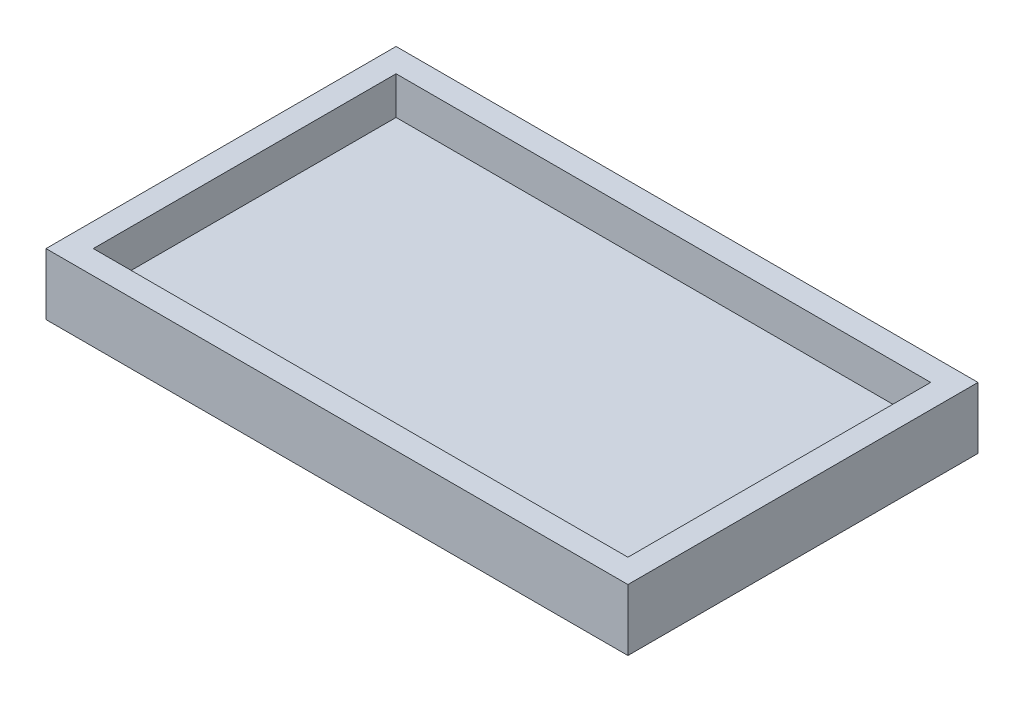
ISO-10303-21;
HEADER;
FILE_DESCRIPTION(('STEP AP214'),'2;1');
FILE_NAME('part.step','',(''),(''),'','','');
FILE_SCHEMA(('AUTOMOTIVE_DESIGN { 1 0 10303 214 1 1 1 1 }'));
ENDSEC;
DATA;
#1=APPLICATION_CONTEXT('core data for automotive mechanical design processes');
#2=APPLICATION_PROTOCOL_DEFINITION('international standard','automotive_design',2000,#1);
#3=PRODUCT_CONTEXT('',#1,'mechanical');
#4=PRODUCT('Part','Part','',(#3));
#5=PRODUCT_RELATED_PRODUCT_CATEGORY('part','',(#4));
#6=PRODUCT_DEFINITION_FORMATION('','',#4);
#7=PRODUCT_DEFINITION_CONTEXT('part definition',#1,'design');
#8=PRODUCT_DEFINITION('design','',#6,#7);
#9=PRODUCT_DEFINITION_SHAPE('','',#8);
#10=(LENGTH_UNIT() NAMED_UNIT(*) SI_UNIT(.MILLI.,.METRE.));
#11=(NAMED_UNIT(*) PLANE_ANGLE_UNIT() SI_UNIT($,.RADIAN.));
#12=(NAMED_UNIT(*) SI_UNIT($,.STERADIAN.) SOLID_ANGLE_UNIT());
#13=UNCERTAINTY_MEASURE_WITH_UNIT(LENGTH_MEASURE(1.E-05),#10,'distance_accuracy_value','');
#14=(GEOMETRIC_REPRESENTATION_CONTEXT(3) GLOBAL_UNCERTAINTY_ASSIGNED_CONTEXT((#13)) GLOBAL_UNIT_ASSIGNED_CONTEXT((#10,
#11,#12)) REPRESENTATION_CONTEXT('',''));
#15=CARTESIAN_POINT('',(0.,0.,0.));
#16=DIRECTION('',(0.,0.,1.));
#17=DIRECTION('',(1.,0.,0.));
#18=AXIS2_PLACEMENT_3D('',#15,#16,#17);
#19=CARTESIAN_POINT('',(-61.5,13.,-37.));
#20=DIRECTION('',(1.,0.,0.));
#21=DIRECTION('',(0.,0.,-1.));
#22=AXIS2_PLACEMENT_3D('',#19,#20,#21);
#23=PLANE('',#22);
#24=DIRECTION('',(0.,0.,1.));
#25=VECTOR('',#24,1.);
#26=CARTESIAN_POINT('',(-61.5,0.,-37.));
#27=LINE('',#26,#25);
#28=CARTESIAN_POINT('',(-61.5,0.,-37.));
#29=VERTEX_POINT('',#28);
#30=CARTESIAN_POINT('',(-61.5,0.,37.));
#31=VERTEX_POINT('',#30);
#32=EDGE_CURVE('E143',#29,#31,#27,.T.);
#33=ORIENTED_EDGE('',*,*,#32,.T.);
#34=DIRECTION('',(0.,-1.,0.));
#35=VECTOR('',#34,1.);
#36=CARTESIAN_POINT('',(-61.5,13.,37.));
#37=LINE('',#36,#35);
#38=CARTESIAN_POINT('',(-61.5,13.,37.));
#39=VERTEX_POINT('',#38);
#40=EDGE_CURVE('E11',#39,#31,#37,.T.);
#41=ORIENTED_EDGE('',*,*,#40,.F.);
#42=DIRECTION('',(0.,0.,1.));
#43=VECTOR('',#42,1.);
#44=CARTESIAN_POINT('',(-61.5,13.,-37.));
#45=LINE('',#44,#43);
#46=CARTESIAN_POINT('',(-61.5,13.,-37.));
#47=VERTEX_POINT('',#46);
#48=EDGE_CURVE('E147',#47,#39,#45,.T.);
#49=ORIENTED_EDGE('',*,*,#48,.F.);
#50=DIRECTION('',(0.,-1.,0.));
#51=VECTOR('',#50,1.);
#52=CARTESIAN_POINT('',(-61.5,13.,-37.));
#53=LINE('',#52,#51);
#54=EDGE_CURVE('E153',#47,#29,#53,.T.);
#55=ORIENTED_EDGE('',*,*,#54,.T.);
#56=EDGE_LOOP('',(#33,#41,#49,#55));
#57=FACE_BOUND('',#56,.T.);
#58=ADVANCED_FACE('F35',(#57),#23,.F.);
#59=CARTESIAN_POINT('',(61.5,13.,37.));
#60=DIRECTION('',(0.,0.,-1.));
#61=DIRECTION('',(-1.,0.,0.));
#62=AXIS2_PLACEMENT_3D('',#59,#60,#61);
#63=PLANE('',#62);
#64=DIRECTION('',(1.,0.,0.));
#65=VECTOR('',#64,1.);
#66=CARTESIAN_POINT('',(61.5,0.,37.));
#67=LINE('',#66,#65);
#68=CARTESIAN_POINT('',(61.5,0.,37.));
#69=VERTEX_POINT('',#68);
#70=EDGE_CURVE('E156',#31,#69,#67,.T.);
#71=ORIENTED_EDGE('',*,*,#70,.T.);
#72=DIRECTION('',(0.,-1.,0.));
#73=VECTOR('',#72,1.);
#74=CARTESIAN_POINT('',(61.5,13.,37.));
#75=LINE('',#74,#73);
#76=CARTESIAN_POINT('',(61.5,13.,37.));
#77=VERTEX_POINT('',#76);
#78=EDGE_CURVE('E42',#77,#69,#75,.T.);
#79=ORIENTED_EDGE('',*,*,#78,.F.);
#80=DIRECTION('',(1.,0.,0.));
#81=VECTOR('',#80,1.);
#82=CARTESIAN_POINT('',(61.5,13.,37.));
#83=LINE('',#82,#81);
#84=EDGE_CURVE('E86',#39,#77,#83,.T.);
#85=ORIENTED_EDGE('',*,*,#84,.F.);
#86=ORIENTED_EDGE('',*,*,#40,.T.);
#87=EDGE_LOOP('',(#71,#79,#85,#86));
#88=FACE_BOUND('',#87,.T.);
#89=ADVANCED_FACE('F185',(#88),#63,.F.);
#90=CARTESIAN_POINT('',(61.5,13.,-37.));
#91=DIRECTION('',(-1.,0.,0.));
#92=DIRECTION('',(0.,0.,1.));
#93=AXIS2_PLACEMENT_3D('',#90,#91,#92);
#94=PLANE('',#93);
#95=DIRECTION('',(0.,0.,-1.));
#96=VECTOR('',#95,1.);
#97=CARTESIAN_POINT('',(61.5,0.,-37.));
#98=LINE('',#97,#96);
#99=CARTESIAN_POINT('',(61.5,0.,-37.));
#100=VERTEX_POINT('',#99);
#101=EDGE_CURVE('E158',#69,#100,#98,.T.);
#102=ORIENTED_EDGE('',*,*,#101,.T.);
#103=DIRECTION('',(0.,-1.,0.));
#104=VECTOR('',#103,1.);
#105=CARTESIAN_POINT('',(61.5,13.,-37.));
#106=LINE('',#105,#104);
#107=CARTESIAN_POINT('',(61.5,13.,-37.));
#108=VERTEX_POINT('',#107);
#109=EDGE_CURVE('E162',#108,#100,#106,.T.);
#110=ORIENTED_EDGE('',*,*,#109,.F.);
#111=DIRECTION('',(0.,0.,-1.));
#112=VECTOR('',#111,1.);
#113=CARTESIAN_POINT('',(61.5,13.,-37.));
#114=LINE('',#113,#112);
#115=EDGE_CURVE('E150',#77,#108,#114,.T.);
#116=ORIENTED_EDGE('',*,*,#115,.F.);
#117=ORIENTED_EDGE('',*,*,#78,.T.);
#118=EDGE_LOOP('',(#102,#110,#116,#117));
#119=FACE_BOUND('',#118,.T.);
#120=ADVANCED_FACE('F167',(#119),#94,.F.);
#121=CARTESIAN_POINT('',(61.5,13.,-37.));
#122=DIRECTION('',(0.,0.,1.));
#123=DIRECTION('',(1.,0.,0.));
#124=AXIS2_PLACEMENT_3D('',#121,#122,#123);
#125=PLANE('',#124);
#126=DIRECTION('',(-1.,0.,0.));
#127=VECTOR('',#126,1.);
#128=CARTESIAN_POINT('',(61.5,0.,-37.));
#129=LINE('',#128,#127);
#130=EDGE_CURVE('E79',#100,#29,#129,.T.);
#131=ORIENTED_EDGE('',*,*,#130,.T.);
#132=ORIENTED_EDGE('',*,*,#54,.F.);
#133=DIRECTION('',(-1.,0.,0.));
#134=VECTOR('',#133,1.);
#135=CARTESIAN_POINT('',(61.5,13.,-37.));
#136=LINE('',#135,#134);
#137=EDGE_CURVE('E58',#108,#47,#136,.T.);
#138=ORIENTED_EDGE('',*,*,#137,.F.);
#139=ORIENTED_EDGE('',*,*,#109,.T.);
#140=EDGE_LOOP('',(#131,#132,#138,#139));
#141=FACE_BOUND('',#140,.T.);
#142=ADVANCED_FACE('F175',(#141),#125,.F.);
#143=CARTESIAN_POINT('',(0.,13.,0.));
#144=DIRECTION('',(0.,-1.,0.));
#145=DIRECTION('',(0.,0.,-1.));
#146=AXIS2_PLACEMENT_3D('',#143,#144,#145);
#147=PLANE('',#146);
#148=DIRECTION('',(-1.,0.,0.));
#149=VECTOR('',#148,1.);
#150=CARTESIAN_POINT('',(-56.5,13.,-32.));
#151=LINE('',#150,#149);
#152=CARTESIAN_POINT('',(56.5,13.,-32.));
#153=VERTEX_POINT('',#152);
#154=CARTESIAN_POINT('',(-56.5,13.,-32.));
#155=VERTEX_POINT('',#154);
#156=EDGE_CURVE('E137',#153,#155,#151,.T.);
#157=ORIENTED_EDGE('',*,*,#156,.F.);
#158=DIRECTION('',(0.,0.,-1.));
#159=VECTOR('',#158,1.);
#160=CARTESIAN_POINT('',(56.5,13.,-32.));
#161=LINE('',#160,#159);
#162=CARTESIAN_POINT('',(56.5,13.,32.));
#163=VERTEX_POINT('',#162);
#164=EDGE_CURVE('E49',#163,#153,#161,.T.);
#165=ORIENTED_EDGE('',*,*,#164,.F.);
#166=DIRECTION('',(1.,0.,0.));
#167=VECTOR('',#166,1.);
#168=CARTESIAN_POINT('',(-56.5,13.,32.));
#169=LINE('',#168,#167);
#170=CARTESIAN_POINT('',(-56.5,13.,32.));
#171=VERTEX_POINT('',#170);
#172=EDGE_CURVE('E128',#171,#163,#169,.T.);
#173=ORIENTED_EDGE('',*,*,#172,.F.);
#174=DIRECTION('',(0.,0.,1.));
#175=VECTOR('',#174,1.);
#176=CARTESIAN_POINT('',(-56.5,13.,-32.));
#177=LINE('',#176,#175);
#178=EDGE_CURVE('E131',#155,#171,#177,.T.);
#179=ORIENTED_EDGE('',*,*,#178,.F.);
#180=EDGE_LOOP('',(#157,#165,#173,#179));
#181=FACE_BOUND('',#180,.T.);
#182=ORIENTED_EDGE('',*,*,#48,.T.);
#183=ORIENTED_EDGE('',*,*,#84,.T.);
#184=ORIENTED_EDGE('',*,*,#115,.T.);
#185=ORIENTED_EDGE('',*,*,#137,.T.);
#186=EDGE_LOOP('',(#182,#183,#184,#185));
#187=FACE_BOUND('',#186,.T.);
#188=ADVANCED_FACE('F177',(#181,#187),#147,.F.);
#189=CARTESIAN_POINT('',(0.,0.,0.));
#190=DIRECTION('',(0.,-1.,0.));
#191=DIRECTION('',(0.,0.,-1.));
#192=AXIS2_PLACEMENT_3D('',#189,#190,#191);
#193=PLANE('',#192);
#194=ORIENTED_EDGE('',*,*,#32,.F.);
#195=ORIENTED_EDGE('',*,*,#130,.F.);
#196=ORIENTED_EDGE('',*,*,#101,.F.);
#197=ORIENTED_EDGE('',*,*,#70,.F.);
#198=EDGE_LOOP('',(#194,#195,#196,#197));
#199=FACE_BOUND('',#198,.T.);
#200=ADVANCED_FACE('F171',(#199),#193,.T.);
#201=CARTESIAN_POINT('',(56.5,5.,-32.));
#202=DIRECTION('',(1.,0.,0.));
#203=DIRECTION('',(0.,0.,-1.));
#204=AXIS2_PLACEMENT_3D('',#201,#202,#203);
#205=PLANE('',#204);
#206=ORIENTED_EDGE('',*,*,#164,.T.);
#207=DIRECTION('',(0.,1.,0.));
#208=VECTOR('',#207,1.);
#209=CARTESIAN_POINT('',(56.5,5.,-32.));
#210=LINE('',#209,#208);
#211=CARTESIAN_POINT('',(56.5,5.,-32.));
#212=VERTEX_POINT('',#211);
#213=EDGE_CURVE('E106',#212,#153,#210,.T.);
#214=ORIENTED_EDGE('',*,*,#213,.F.);
#215=DIRECTION('',(0.,0.,-1.));
#216=VECTOR('',#215,1.);
#217=CARTESIAN_POINT('',(56.5,5.,-32.));
#218=LINE('',#217,#216);
#219=CARTESIAN_POINT('',(56.5,5.,32.));
#220=VERTEX_POINT('',#219);
#221=EDGE_CURVE('E110',#220,#212,#218,.T.);
#222=ORIENTED_EDGE('',*,*,#221,.F.);
#223=DIRECTION('',(0.,1.,0.));
#224=VECTOR('',#223,1.);
#225=CARTESIAN_POINT('',(56.5,5.,32.));
#226=LINE('',#225,#224);
#227=EDGE_CURVE('E141',#220,#163,#226,.T.);
#228=ORIENTED_EDGE('',*,*,#227,.T.);
#229=EDGE_LOOP('',(#206,#214,#222,#228));
#230=FACE_BOUND('',#229,.T.);
#231=ADVANCED_FACE('F108',(#230),#205,.F.);
#232=CARTESIAN_POINT('',(-56.5,5.,32.));
#233=DIRECTION('',(0.,0.,1.));
#234=DIRECTION('',(1.,0.,0.));
#235=AXIS2_PLACEMENT_3D('',#232,#233,#234);
#236=PLANE('',#235);
#237=ORIENTED_EDGE('',*,*,#172,.T.);
#238=ORIENTED_EDGE('',*,*,#227,.F.);
#239=DIRECTION('',(1.,0.,0.));
#240=VECTOR('',#239,1.);
#241=CARTESIAN_POINT('',(-56.5,5.,32.));
#242=LINE('',#241,#240);
#243=CARTESIAN_POINT('',(-56.5,5.,32.));
#244=VERTEX_POINT('',#243);
#245=EDGE_CURVE('E116',#244,#220,#242,.T.);
#246=ORIENTED_EDGE('',*,*,#245,.F.);
#247=DIRECTION('',(0.,1.,0.));
#248=VECTOR('',#247,1.);
#249=CARTESIAN_POINT('',(-56.5,5.,32.));
#250=LINE('',#249,#248);
#251=EDGE_CURVE('E144',#244,#171,#250,.T.);
#252=ORIENTED_EDGE('',*,*,#251,.T.);
#253=EDGE_LOOP('',(#237,#238,#246,#252));
#254=FACE_BOUND('',#253,.T.);
#255=ADVANCED_FACE('F224',(#254),#236,.F.);
#256=CARTESIAN_POINT('',(-56.5,5.,-32.));
#257=DIRECTION('',(-1.,0.,0.));
#258=DIRECTION('',(0.,0.,1.));
#259=AXIS2_PLACEMENT_3D('',#256,#257,#258);
#260=PLANE('',#259);
#261=ORIENTED_EDGE('',*,*,#178,.T.);
#262=ORIENTED_EDGE('',*,*,#251,.F.);
#263=DIRECTION('',(0.,0.,1.));
#264=VECTOR('',#263,1.);
#265=CARTESIAN_POINT('',(-56.5,5.,-32.));
#266=LINE('',#265,#264);
#267=CARTESIAN_POINT('',(-56.5,5.,-32.));
#268=VERTEX_POINT('',#267);
#269=EDGE_CURVE('E124',#268,#244,#266,.T.);
#270=ORIENTED_EDGE('',*,*,#269,.F.);
#271=DIRECTION('',(0.,1.,0.));
#272=VECTOR('',#271,1.);
#273=CARTESIAN_POINT('',(-56.5,5.,-32.));
#274=LINE('',#273,#272);
#275=EDGE_CURVE('E115',#268,#155,#274,.T.);
#276=ORIENTED_EDGE('',*,*,#275,.T.);
#277=EDGE_LOOP('',(#261,#262,#270,#276));
#278=FACE_BOUND('',#277,.T.);
#279=ADVANCED_FACE('F233',(#278),#260,.F.);
#280=CARTESIAN_POINT('',(-56.5,5.,-32.));
#281=DIRECTION('',(0.,0.,-1.));
#282=DIRECTION('',(-1.,0.,0.));
#283=AXIS2_PLACEMENT_3D('',#280,#281,#282);
#284=PLANE('',#283);
#285=ORIENTED_EDGE('',*,*,#156,.T.);
#286=ORIENTED_EDGE('',*,*,#275,.F.);
#287=DIRECTION('',(-1.,0.,0.));
#288=VECTOR('',#287,1.);
#289=CARTESIAN_POINT('',(-56.5,5.,-32.));
#290=LINE('',#289,#288);
#291=EDGE_CURVE('E119',#212,#268,#290,.T.);
#292=ORIENTED_EDGE('',*,*,#291,.F.);
#293=ORIENTED_EDGE('',*,*,#213,.T.);
#294=EDGE_LOOP('',(#285,#286,#292,#293));
#295=FACE_BOUND('',#294,.T.);
#296=ADVANCED_FACE('F120',(#295),#284,.F.);
#297=CARTESIAN_POINT('',(0.,5.,0.));
#298=DIRECTION('',(0.,1.,0.));
#299=DIRECTION('',(0.,0.,1.));
#300=AXIS2_PLACEMENT_3D('',#297,#298,#299);
#301=PLANE('',#300);
#302=ORIENTED_EDGE('',*,*,#221,.T.);
#303=ORIENTED_EDGE('',*,*,#291,.T.);
#304=ORIENTED_EDGE('',*,*,#269,.T.);
#305=ORIENTED_EDGE('',*,*,#245,.T.);
#306=EDGE_LOOP('',(#302,#303,#304,#305));
#307=FACE_BOUND('',#306,.T.);
#308=ADVANCED_FACE('F126',(#307),#301,.T.);
#309=CLOSED_SHELL('',(#58,#89,#120,#142,#188,#200,#231,#255,#279,#296,#308));
#310=MANIFOLD_SOLID_BREP('B2',#309);
#311=ADVANCED_BREP_SHAPE_REPRESENTATION('',(#18,#310),#14);
#312=SHAPE_DEFINITION_REPRESENTATION(#9,#311);
ENDSEC;
END-ISO-10303-21;
